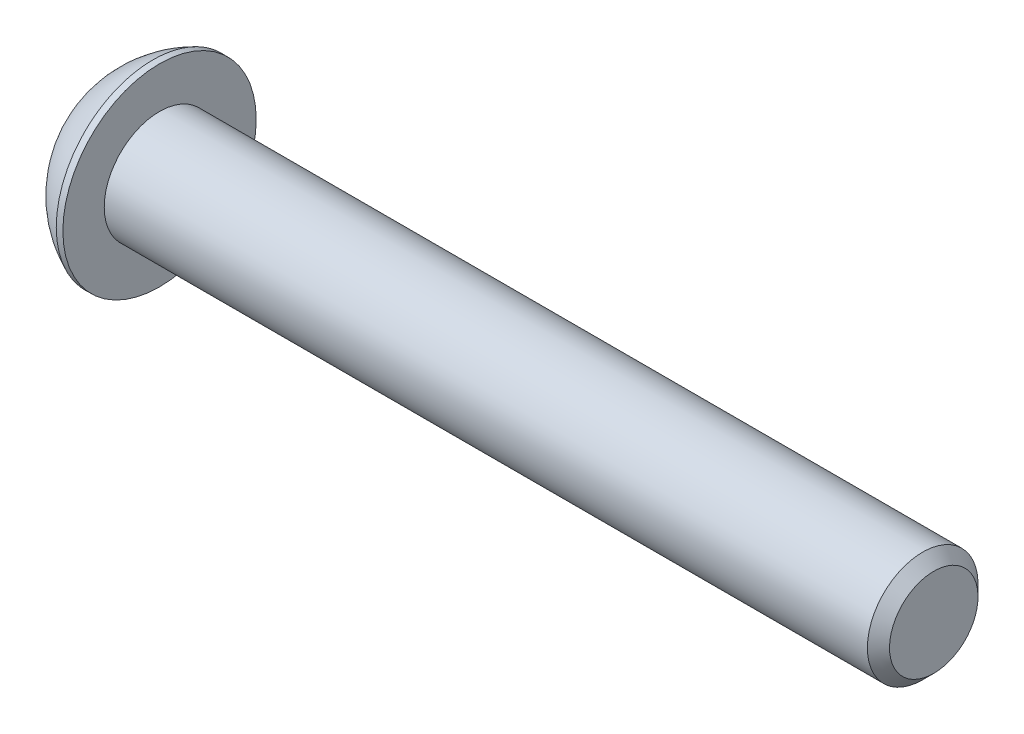
ISO-10303-21;
HEADER;
FILE_DESCRIPTION(('STEP AP214'),'2;1');
FILE_NAME('part.step','',(''),(''),'','','');
FILE_SCHEMA(('AUTOMOTIVE_DESIGN { 1 0 10303 214 1 1 1 1 }'));
ENDSEC;
DATA;
#1=APPLICATION_CONTEXT('core data for automotive mechanical design processes');
#2=APPLICATION_PROTOCOL_DEFINITION('international standard','automotive_design',2000,#1);
#3=PRODUCT_CONTEXT('',#1,'mechanical');
#4=PRODUCT('Part','Part','',(#3));
#5=PRODUCT_RELATED_PRODUCT_CATEGORY('part','',(#4));
#6=PRODUCT_DEFINITION_FORMATION('','',#4);
#7=PRODUCT_DEFINITION_CONTEXT('part definition',#1,'design');
#8=PRODUCT_DEFINITION('design','',#6,#7);
#9=PRODUCT_DEFINITION_SHAPE('','',#8);
#10=(LENGTH_UNIT() NAMED_UNIT(*) SI_UNIT(.MILLI.,.METRE.));
#11=(NAMED_UNIT(*) PLANE_ANGLE_UNIT() SI_UNIT($,.RADIAN.));
#12=(NAMED_UNIT(*) SI_UNIT($,.STERADIAN.) SOLID_ANGLE_UNIT());
#13=UNCERTAINTY_MEASURE_WITH_UNIT(LENGTH_MEASURE(1.E-05),#10,'distance_accuracy_value','');
#14=(GEOMETRIC_REPRESENTATION_CONTEXT(3) GLOBAL_UNCERTAINTY_ASSIGNED_CONTEXT((#13)) GLOBAL_UNIT_ASSIGNED_CONTEXT((#10,
#11,#12)) REPRESENTATION_CONTEXT('',''));
#15=CARTESIAN_POINT('',(0.,0.,0.));
#16=DIRECTION('',(0.,0.,1.));
#17=DIRECTION('',(1.,0.,0.));
#18=AXIS2_PLACEMENT_3D('',#15,#16,#17);
#19=CARTESIAN_POINT('',(1.32080000000034,0.,0.));
#20=DIRECTION('',(-1.,0.,0.));
#21=DIRECTION('',(0.,0.,1.));
#22=AXIS2_PLACEMENT_3D('',#19,#20,#21);
#23=CONICAL_SURFACE('',#22,1.1937999999998,1.04719755119608);
#24=CARTESIAN_POINT('',(2.01004075135902,0.,-4.44089209850063E-13));
#25=VERTEX_POINT('',#24);
#26=VERTEX_LOOP('',#25);
#27=FACE_BOUND('',#26,.T.);
#28=CARTESIAN_POINT('',(1.32080000000009,0.,0.));
#29=DIRECTION('',(-1.,0.,0.));
#30=DIRECTION('',(0.,0.,1.));
#31=AXIS2_PLACEMENT_3D('',#28,#29,#30);
#32=CIRCLE('',#31,1.19380000000024);
#33=CARTESIAN_POINT('',(1.32080000000009,0.,1.19380000000024));
#34=VERTEX_POINT('',#33);
#35=EDGE_CURVE('E20',#34,#34,#32,.T.);
#36=ORIENTED_EDGE('',*,*,#35,.T.);
#37=EDGE_LOOP('',(#36));
#38=FACE_BOUND('',#37,.T.);
#39=ADVANCED_FACE('F17',(#27,#38),#23,.F.);
#40=CARTESIAN_POINT('',(1.3208,-2.29135888084633,0.));
#41=DIRECTION('',(1.,0.,0.));
#42=DIRECTION('',(0.,0.,-1.));
#43=AXIS2_PLACEMENT_3D('',#40,#41,#42);
#44=PLANE('',#43);
#45=DIRECTION('',(0.,1.,0.));
#46=VECTOR('',#45,1.);
#47=CARTESIAN_POINT('',(1.3208,-1.14567944042316,1.984375));
#48=LINE('',#47,#46);
#49=CARTESIAN_POINT('',(1.3208,1.14567944042316,1.984375));
#50=VERTEX_POINT('',#49);
#51=CARTESIAN_POINT('',(1.3208,-1.14567944042316,1.984375));
#52=VERTEX_POINT('',#51);
#53=EDGE_CURVE('E69',#50,#52,#48,.F.);
#54=ORIENTED_EDGE('',*,*,#53,.F.);
#55=DIRECTION('',(0.,0.5,-0.866025403784439));
#56=VECTOR('',#55,1.);
#57=CARTESIAN_POINT('',(1.3208,1.14567944042316,1.984375));
#58=LINE('',#57,#56);
#59=CARTESIAN_POINT('',(1.3208,2.29135888084633,0.));
#60=VERTEX_POINT('',#59);
#61=EDGE_CURVE('E287',#60,#50,#58,.F.);
#62=ORIENTED_EDGE('',*,*,#61,.F.);
#63=DIRECTION('',(0.,-0.5,-0.866025403784439));
#64=VECTOR('',#63,1.);
#65=CARTESIAN_POINT('',(1.3208,2.29135888084633,0.));
#66=LINE('',#65,#64);
#67=CARTESIAN_POINT('',(1.3208,1.14567944042316,-1.984375));
#68=VERTEX_POINT('',#67);
#69=EDGE_CURVE('E291',#68,#60,#66,.F.);
#70=ORIENTED_EDGE('',*,*,#69,.F.);
#71=DIRECTION('',(0.,1.,0.));
#72=VECTOR('',#71,1.);
#73=CARTESIAN_POINT('',(1.3208,1.14567944042316,-1.984375));
#74=LINE('',#73,#72);
#75=CARTESIAN_POINT('',(1.3208,-1.14567944042316,-1.984375));
#76=VERTEX_POINT('',#75);
#77=EDGE_CURVE('E296',#76,#68,#74,.T.);
#78=ORIENTED_EDGE('',*,*,#77,.F.);
#79=DIRECTION('',(0.,-0.500000000000001,0.866025403784438));
#80=VECTOR('',#79,1.);
#81=CARTESIAN_POINT('',(1.3208,-1.14567944042316,-1.984375));
#82=LINE('',#81,#80);
#83=CARTESIAN_POINT('',(1.3208,-2.29135888084633,0.));
#84=VERTEX_POINT('',#83);
#85=EDGE_CURVE('E301',#84,#76,#82,.F.);
#86=ORIENTED_EDGE('',*,*,#85,.F.);
#87=DIRECTION('',(0.,0.500000000000001,0.866025403784438));
#88=VECTOR('',#87,1.);
#89=CARTESIAN_POINT('',(1.3208,-2.29135888084633,0.));
#90=LINE('',#89,#88);
#91=EDGE_CURVE('E82',#52,#84,#90,.F.);
#92=ORIENTED_EDGE('',*,*,#91,.F.);
#93=EDGE_LOOP('',(#54,#62,#70,#78,#86,#92));
#94=FACE_BOUND('',#93,.T.);
#95=ORIENTED_EDGE('',*,*,#35,.F.);
#96=EDGE_LOOP('',(#95));
#97=FACE_BOUND('',#96,.T.);
#98=ADVANCED_FACE('F75',(#94,#97),#44,.F.);
#99=CARTESIAN_POINT('',(1.3208,-1.14567944042316,1.984375));
#100=DIRECTION('',(0.,0.,-1.));
#101=DIRECTION('',(0.,1.,0.));
#102=AXIS2_PLACEMENT_3D('',#99,#100,#101);
#103=PLANE('',#102);
#104=ORIENTED_EDGE('',*,*,#53,.T.);
#105=DIRECTION('',(1.,0.,0.));
#106=VECTOR('',#105,1.);
#107=CARTESIAN_POINT('',(1.3208,-1.14567944042316,1.984375));
#108=LINE('',#107,#106);
#109=CARTESIAN_POINT('',(0.,-1.14567944042316,1.984375));
#110=VERTEX_POINT('',#109);
#111=EDGE_CURVE('E79',#110,#52,#108,.T.);
#112=ORIENTED_EDGE('',*,*,#111,.F.);
#113=DIRECTION('',(0.,1.,0.));
#114=VECTOR('',#113,1.);
#115=CARTESIAN_POINT('',(0.,0.,1.984375));
#116=LINE('',#115,#114);
#117=CARTESIAN_POINT('',(0.,1.14567944042316,1.984375));
#118=VERTEX_POINT('',#117);
#119=EDGE_CURVE('E281',#118,#110,#116,.F.);
#120=ORIENTED_EDGE('',*,*,#119,.F.);
#121=DIRECTION('',(1.,0.,0.));
#122=VECTOR('',#121,1.);
#123=CARTESIAN_POINT('',(1.3208,1.14567944042316,1.984375));
#124=LINE('',#123,#122);
#125=EDGE_CURVE('E284',#50,#118,#124,.F.);
#126=ORIENTED_EDGE('',*,*,#125,.F.);
#127=EDGE_LOOP('',(#104,#112,#120,#126));
#128=FACE_BOUND('',#127,.T.);
#129=ADVANCED_FACE('F128',(#128),#103,.T.);
#130=CARTESIAN_POINT('',(1.3208,-2.29135888084633,0.));
#131=DIRECTION('',(0.,0.866025403784438,-0.500000000000001));
#132=DIRECTION('',(0.,0.500000000000001,0.866025403784438));
#133=AXIS2_PLACEMENT_3D('',#130,#131,#132);
#134=PLANE('',#133);
#135=ORIENTED_EDGE('',*,*,#91,.T.);
#136=DIRECTION('',(1.,0.,0.));
#137=VECTOR('',#136,1.);
#138=CARTESIAN_POINT('',(1.3208,-2.29135888084633,0.));
#139=LINE('',#138,#137);
#140=CARTESIAN_POINT('',(0.,-2.29135888084633,0.));
#141=VERTEX_POINT('',#140);
#142=EDGE_CURVE('E303',#141,#84,#139,.T.);
#143=ORIENTED_EDGE('',*,*,#142,.F.);
#144=DIRECTION('',(0.,-0.500000000000001,-0.866025403784438));
#145=VECTOR('',#144,1.);
#146=CARTESIAN_POINT('',(0.,-1.14567944042316,1.984375));
#147=LINE('',#146,#145);
#148=EDGE_CURVE('E278',#110,#141,#147,.T.);
#149=ORIENTED_EDGE('',*,*,#148,.F.);
#150=ORIENTED_EDGE('',*,*,#111,.T.);
#151=EDGE_LOOP('',(#135,#143,#149,#150));
#152=FACE_BOUND('',#151,.T.);
#153=ADVANCED_FACE('F124',(#152),#134,.T.);
#154=CARTESIAN_POINT('',(1.3208,-1.14567944042316,-1.984375));
#155=DIRECTION('',(0.,0.866025403784438,0.500000000000001));
#156=DIRECTION('',(0.,-0.500000000000001,0.866025403784438));
#157=AXIS2_PLACEMENT_3D('',#154,#155,#156);
#158=PLANE('',#157);
#159=ORIENTED_EDGE('',*,*,#85,.T.);
#160=DIRECTION('',(1.,0.,0.));
#161=VECTOR('',#160,1.);
#162=CARTESIAN_POINT('',(1.3208,-1.14567944042316,-1.984375));
#163=LINE('',#162,#161);
#164=CARTESIAN_POINT('',(0.,-1.14567944042316,-1.984375));
#165=VERTEX_POINT('',#164);
#166=EDGE_CURVE('E298',#165,#76,#163,.T.);
#167=ORIENTED_EDGE('',*,*,#166,.F.);
#168=DIRECTION('',(0.,0.500000000000001,-0.866025403784438));
#169=VECTOR('',#168,1.);
#170=CARTESIAN_POINT('',(0.,-2.29135888084633,0.));
#171=LINE('',#170,#169);
#172=EDGE_CURVE('E275',#141,#165,#171,.T.);
#173=ORIENTED_EDGE('',*,*,#172,.F.);
#174=ORIENTED_EDGE('',*,*,#142,.T.);
#175=EDGE_LOOP('',(#159,#167,#173,#174));
#176=FACE_BOUND('',#175,.T.);
#177=ADVANCED_FACE('F120',(#176),#158,.T.);
#178=CARTESIAN_POINT('',(1.3208,1.14567944042316,-1.984375));
#179=DIRECTION('',(0.,0.,1.));
#180=DIRECTION('',(1.,0.,0.));
#181=AXIS2_PLACEMENT_3D('',#178,#179,#180);
#182=PLANE('',#181);
#183=ORIENTED_EDGE('',*,*,#77,.T.);
#184=DIRECTION('',(1.,0.,0.));
#185=VECTOR('',#184,1.);
#186=CARTESIAN_POINT('',(1.3208,1.14567944042316,-1.984375));
#187=LINE('',#186,#185);
#188=CARTESIAN_POINT('',(0.,1.14567944042316,-1.984375));
#189=VERTEX_POINT('',#188);
#190=EDGE_CURVE('E293',#189,#68,#187,.T.);
#191=ORIENTED_EDGE('',*,*,#190,.F.);
#192=DIRECTION('',(0.,1.,0.));
#193=VECTOR('',#192,1.);
#194=CARTESIAN_POINT('',(0.,0.,-1.984375));
#195=LINE('',#194,#193);
#196=EDGE_CURVE('E272',#165,#189,#195,.T.);
#197=ORIENTED_EDGE('',*,*,#196,.F.);
#198=ORIENTED_EDGE('',*,*,#166,.T.);
#199=EDGE_LOOP('',(#183,#191,#197,#198));
#200=FACE_BOUND('',#199,.T.);
#201=ADVANCED_FACE('F117',(#200),#182,.T.);
#202=CARTESIAN_POINT('',(1.3208,2.29135888084633,0.));
#203=DIRECTION('',(0.,-0.866025403784439,0.5));
#204=DIRECTION('',(0.,-0.5,-0.866025403784439));
#205=AXIS2_PLACEMENT_3D('',#202,#203,#204);
#206=PLANE('',#205);
#207=ORIENTED_EDGE('',*,*,#69,.T.);
#208=DIRECTION('',(1.,0.,0.));
#209=VECTOR('',#208,1.);
#210=CARTESIAN_POINT('',(1.3208,2.29135888084633,0.));
#211=LINE('',#210,#209);
#212=CARTESIAN_POINT('',(0.,2.29135888084633,0.));
#213=VERTEX_POINT('',#212);
#214=EDGE_CURVE('E35',#213,#60,#211,.T.);
#215=ORIENTED_EDGE('',*,*,#214,.F.);
#216=DIRECTION('',(0.,0.5,0.866025403784439));
#217=VECTOR('',#216,1.);
#218=CARTESIAN_POINT('',(0.,1.14567944042316,-1.984375));
#219=LINE('',#218,#217);
#220=EDGE_CURVE('E269',#189,#213,#219,.T.);
#221=ORIENTED_EDGE('',*,*,#220,.F.);
#222=ORIENTED_EDGE('',*,*,#190,.T.);
#223=EDGE_LOOP('',(#207,#215,#221,#222));
#224=FACE_BOUND('',#223,.T.);
#225=ADVANCED_FACE('F113',(#224),#206,.T.);
#226=CARTESIAN_POINT('',(1.3208,1.14567944042316,1.984375));
#227=DIRECTION('',(0.,-0.866025403784439,-0.5));
#228=DIRECTION('',(0.,0.5,-0.866025403784439));
#229=AXIS2_PLACEMENT_3D('',#226,#227,#228);
#230=PLANE('',#229);
#231=ORIENTED_EDGE('',*,*,#61,.T.);
#232=ORIENTED_EDGE('',*,*,#125,.T.);
#233=DIRECTION('',(0.,-0.5,0.866025403784438));
#234=VECTOR('',#233,1.);
#235=CARTESIAN_POINT('',(0.,2.29135888084633,0.));
#236=LINE('',#235,#234);
#237=EDGE_CURVE('E100',#213,#118,#236,.T.);
#238=ORIENTED_EDGE('',*,*,#237,.F.);
#239=ORIENTED_EDGE('',*,*,#214,.T.);
#240=EDGE_LOOP('',(#231,#232,#238,#239));
#241=FACE_BOUND('',#240,.T.);
#242=ADVANCED_FACE('F109',(#241),#230,.T.);
#243=CARTESIAN_POINT('',(0.,0.,0.));
#244=DIRECTION('',(-1.,0.,0.));
#245=DIRECTION('',(0.,0.,1.));
#246=AXIS2_PLACEMENT_3D('',#243,#244,#245);
#247=PLANE('',#246);
#248=ORIENTED_EDGE('',*,*,#220,.T.);
#249=ORIENTED_EDGE('',*,*,#237,.T.);
#250=ORIENTED_EDGE('',*,*,#119,.T.);
#251=ORIENTED_EDGE('',*,*,#148,.T.);
#252=ORIENTED_EDGE('',*,*,#172,.T.);
#253=ORIENTED_EDGE('',*,*,#196,.T.);
#254=EDGE_LOOP('',(#248,#249,#250,#251,#252,#253));
#255=FACE_BOUND('',#254,.T.);
#256=CARTESIAN_POINT('',(0.,2.77495,0.));
#257=CARTESIAN_POINT('',(0.,2.77494953309947,0.0779118937523459));
#258=CARTESIAN_POINT('',(0.,2.77166578388025,0.15583810591977));
#259=CARTESIAN_POINT('',(0.,2.75855213600204,0.311152012455904));
#260=CARTESIAN_POINT('',(0.,2.74872030471467,0.388539541019556));
#261=CARTESIAN_POINT('',(0.,2.72255472645676,0.542341518735717));
#262=CARTESIAN_POINT('',(-2.70414110576258E-13,2.70621065843663,0.618754223567578));
#263=CARTESIAN_POINT('',(2.71501725221868E-13,2.66713326915777,0.769973634286023));
#264=CARTESIAN_POINT('',(1.01274952524446E-12,2.64439476297869,0.844778983646282));
#265=CARTESIAN_POINT('',(1.81909959813207E-12,2.56690195943351,1.06566239301792));
#266=CARTESIAN_POINT('',(4.77081687541822E-13,2.50280672569928,1.20857954243987));
#267=CARTESIAN_POINT('',(-4.76232447128612E-13,2.35149826934097,1.48160874561538));
#268=CARTESIAN_POINT('',(0.,2.26428416790397,1.61172031233499));
#269=CARTESIAN_POINT('',(0.,2.1181093928834,1.79445660654268));
#270=CARTESIAN_POINT('',(0.,2.06678693791626,1.85333128513996));
#271=CARTESIAN_POINT('',(0.,1.95940522984449,1.96650727912792));
#272=CARTESIAN_POINT('',(0.,1.90335059143535,2.02081294920044));
#273=CARTESIAN_POINT('',(0.,1.78683891013963,2.12453280878582));
#274=CARTESIAN_POINT('',(0.,1.72637988450322,2.1739447713554));
#275=CARTESIAN_POINT('',(0.,1.60151968865711,2.26750481692908));
#276=CARTESIAN_POINT('',(0.,1.53711760864537,2.31165167810847));
#277=CARTESIAN_POINT('',(0.,1.33869902291632,2.43567242603944));
#278=CARTESIAN_POINT('',(0.,1.19934704110695,2.507235886628));
#279=CARTESIAN_POINT('',(0.,0.910681609121881,2.62590828672821));
#280=CARTESIAN_POINT('',(0.,0.761368265357398,2.67301748742278));
#281=CARTESIAN_POINT('',(0.,0.456932649466623,2.74151230664007));
#282=CARTESIAN_POINT('',(0.,0.301810346322584,2.76289778778721));
#283=CARTESIAN_POINT('',(0.,-0.00982263870895171,2.77931595661156));
#284=CARTESIAN_POINT('',(0.,-0.166333320596448,2.77434864428877));
#285=CARTESIAN_POINT('',(0.,-0.476280836814452,2.73822217653073));
#286=CARTESIAN_POINT('',(0.,-0.629717687555985,2.70706316096981));
#287=CARTESIAN_POINT('',(0.,-0.929254830044274,2.61937980771149));
#288=CARTESIAN_POINT('',(0.,-1.0753550434132,2.56285519909568));
#289=CARTESIAN_POINT('',(0.,-1.28570692598579,2.46037024128109));
#290=CARTESIAN_POINT('',(0.,-1.35439130022287,2.42323494812896));
#291=CARTESIAN_POINT('',(0.,-1.488391287199,2.34331277270256));
#292=CARTESIAN_POINT('',(0.,-1.55370767631787,2.30052720108831));
#293=CARTESIAN_POINT('',(0.,-1.68047292776594,2.20962421887055));
#294=CARTESIAN_POINT('',(0.,-1.7419235278682,2.16150923122348));
#295=CARTESIAN_POINT('',(0.,-1.86060297067992,2.06024311301283));
#296=CARTESIAN_POINT('',(0.,-1.91782768181715,2.0070871669763));
#297=CARTESIAN_POINT('',(0.,-2.08239462196651,1.8407220856554));
#298=CARTESIAN_POINT('',(0.,-2.18279764272601,1.72049499758422));
#299=CARTESIAN_POINT('',(0.,-2.36195754944063,1.46487629213018));
#300=CARTESIAN_POINT('',(0.,-2.44071525816758,1.32948525142807));
#301=CARTESIAN_POINT('',(0.,-2.54098882695274,1.11796734074395));
#302=CARTESIAN_POINT('',(0.,-2.57146177392727,1.04596540008347));
#303=CARTESIAN_POINT('',(0.,-2.62621251108999,0.899689259475764));
#304=CARTESIAN_POINT('',(0.,-2.65049531495563,0.825416953360952));
#305=CARTESIAN_POINT('',(0.,-2.69267708798766,0.675215808695207));
#306=CARTESIAN_POINT('',(0.,-2.71058613777937,0.599289789313092));
#307=CARTESIAN_POINT('',(0.,-2.73994710360127,0.446213628496932));
#308=CARTESIAN_POINT('',(0.,-2.75140092413871,0.369063855024788));
#309=CARTESIAN_POINT('',(0.,-2.76470470685522,0.24316208817343));
#310=CARTESIAN_POINT('',(0.,-2.76854547596618,0.194611672428577));
#311=CARTESIAN_POINT('',(0.,-2.77366826843264,0.0973760351839812));
#312=CARTESIAN_POINT('',(0.,-2.77495029178814,0.0486908136842395));
#313=CARTESIAN_POINT('',(0.,-2.77494953309947,-0.0779118937523475));
#314=CARTESIAN_POINT('',(0.,-2.77166578388025,-0.155838105919772));
#315=CARTESIAN_POINT('',(0.,-2.75855213600204,-0.311152012455906));
#316=CARTESIAN_POINT('',(0.,-2.74872030471467,-0.388539541019558));
#317=CARTESIAN_POINT('',(0.,-2.72255472645677,-0.542341518735719));
#318=CARTESIAN_POINT('',(-2.70149297926331E-13,-2.70621065843663,-0.61875422356758));
#319=CARTESIAN_POINT('',(2.712366972268E-13,-2.66713326915777,-0.769973634286024));
#320=CARTESIAN_POINT('',(1.0114146773846E-12,-2.64439476297869,-0.844778983646283));
#321=CARTESIAN_POINT('',(1.81656702958366E-12,-2.5669019594335,-1.06566239301792));
#322=CARTESIAN_POINT('',(4.7641829195856E-13,-2.50280672569928,-1.20857954243988));
#323=CARTESIAN_POINT('',(-4.75569026324205E-13,-2.35149826934097,-1.48160874561538));
#324=CARTESIAN_POINT('',(0.,-2.26428416790396,-1.61172031233499));
#325=CARTESIAN_POINT('',(0.,-2.1181093928834,-1.79445660654268));
#326=CARTESIAN_POINT('',(0.,-2.06678693791626,-1.85333128513997));
#327=CARTESIAN_POINT('',(0.,-1.95940522984449,-1.96650727912792));
#328=CARTESIAN_POINT('',(0.,-1.90335059143535,-2.02081294920044));
#329=CARTESIAN_POINT('',(0.,-1.78683891013963,-2.12453280878582));
#330=CARTESIAN_POINT('',(0.,-1.72637988450322,-2.1739447713554));
#331=CARTESIAN_POINT('',(0.,-1.60151968865711,-2.26750481692908));
#332=CARTESIAN_POINT('',(0.,-1.53711760864537,-2.31165167810847));
#333=CARTESIAN_POINT('',(0.,-1.33869902291632,-2.43567242603944));
#334=CARTESIAN_POINT('',(0.,-1.19934704110695,-2.507235886628));
#335=CARTESIAN_POINT('',(0.,-0.91068160912188,-2.62590828672821));
#336=CARTESIAN_POINT('',(0.,-0.761368265357396,-2.67301748742278));
#337=CARTESIAN_POINT('',(0.,-0.456932649466621,-2.74151230664007));
#338=CARTESIAN_POINT('',(0.,-0.301810346322582,-2.76289778778721));
#339=CARTESIAN_POINT('',(0.,0.00982263870895353,-2.77931595661156));
#340=CARTESIAN_POINT('',(0.,0.16633332059645,-2.77434864428876));
#341=CARTESIAN_POINT('',(0.,0.476280836814454,-2.73822217653073));
#342=CARTESIAN_POINT('',(0.,0.629717687555987,-2.70706316096981));
#343=CARTESIAN_POINT('',(0.,0.929254830044276,-2.6193798077115));
#344=CARTESIAN_POINT('',(0.,1.0753550434132,-2.56285519909568));
#345=CARTESIAN_POINT('',(0.,1.28570692598579,-2.46037024128109));
#346=CARTESIAN_POINT('',(0.,1.35439130022287,-2.42323494812896));
#347=CARTESIAN_POINT('',(0.,1.488391287199,-2.34331277270256));
#348=CARTESIAN_POINT('',(0.,1.55370767631787,-2.30052720108831));
#349=CARTESIAN_POINT('',(0.,1.68047292776594,-2.20962421887055));
#350=CARTESIAN_POINT('',(0.,1.7419235278682,-2.16150923122348));
#351=CARTESIAN_POINT('',(0.,1.86060297067992,-2.06024311301282));
#352=CARTESIAN_POINT('',(0.,1.91782768181716,-2.0070871669763));
#353=CARTESIAN_POINT('',(0.,2.08239462196651,-1.8407220856554));
#354=CARTESIAN_POINT('',(0.,2.18279764272601,-1.72049499758422));
#355=CARTESIAN_POINT('',(0.,2.36195754944063,-1.46487629213018));
#356=CARTESIAN_POINT('',(0.,2.44071525816757,-1.32948525142807));
#357=CARTESIAN_POINT('',(0.,2.54098882695273,-1.11796734074395));
#358=CARTESIAN_POINT('',(0.,2.57146177392727,-1.04596540008347));
#359=CARTESIAN_POINT('',(0.,2.62621251108999,-0.899689259475765));
#360=CARTESIAN_POINT('',(0.,2.65049531495563,-0.825416953360953));
#361=CARTESIAN_POINT('',(0.,2.69267708798766,-0.675215808695207));
#362=CARTESIAN_POINT('',(0.,2.71058613777936,-0.599289789313092));
#363=CARTESIAN_POINT('',(0.,2.73994710360127,-0.446213628496932));
#364=CARTESIAN_POINT('',(0.,2.75140092413871,-0.369063855024789));
#365=CARTESIAN_POINT('',(0.,2.76470470685522,-0.243162088173432));
#366=CARTESIAN_POINT('',(0.,2.76854547596618,-0.194611672428578));
#367=CARTESIAN_POINT('',(0.,2.77366826843264,-0.0973760351839823));
#368=CARTESIAN_POINT('',(0.,2.77495029178814,-0.0486908136842408));
#369=CARTESIAN_POINT('',(0.,2.77495,0.));
#370=B_SPLINE_CURVE_WITH_KNOTS('',3,(#256,#257,#258,#259,#260,#261,#262,#263,#264,#265,#266,
#267,#268,#269,#270,#271,#272,#273,#274,#275,#276,#277,#278,#279,#280,#281,#282,#283,#284,#285,
#286,#287,#288,#289,#290,#291,#292,#293,#294,#295,#296,#297,#298,#299,#300,#301,#302,#303,#304,
#305,#306,#307,#308,#309,#310,#311,#312,#313,#314,#315,#316,#317,#318,#319,#320,#321,#322,#323,
#324,#325,#326,#327,#328,#329,#330,#331,#332,#333,#334,#335,#336,#337,#338,#339,#340,#341,#342,
#343,#344,#345,#346,#347,#348,#349,#350,#351,#352,#353,#354,#355,#356,#357,#358,#359,#360,#361,
#362,#363,#364,#365,#366,#367,#368,#369),.UNSPECIFIED.,.T.,.F.,(4,2,2,2,2,2,2,2,2,2,2,2,2,2,2,2,
2,2,2,2,2,2,2,2,2,2,2,2,2,2,2,2,2,2,2,2,2,2,2,2,2,2,2,2,2,2,2,2,2,2,2,2,2,2,2,2,4),(0.,
0.233690856748162,0.467450716578751,0.701582538521471,0.935904756015414,1.40343220467667,
1.87097742791502,2.10505636898837,2.33890962270652,2.57286880998746,2.80688218486306,
3.27442101763127,3.74195485676357,4.20949119271389,4.67702752866417,5.14456136779641,
5.61210020056468,5.84611357544033,6.08007276272136,6.31392601643949,6.54800495751273,
7.01555018075072,7.48307762941212,7.71739984690652,7.95153166884955,8.18529152868023,
8.41898238542855,8.56502681353347,8.71107124163843,8.94476209838659,9.17852195821718,
9.4126537801599,9.64697599765384,10.1145034463151,10.5820486695534,10.8161276106268,
11.0499808643449,11.2839400516259,11.5179534265015,11.9854922592697,12.453026098402,
12.9205624343523,13.3880987703026,13.8556326094348,14.3231714422031,14.5571848170788,
14.7911440043598,15.0249972580779,15.2590761991512,15.7266214223891,16.1941488710506,
16.4284710885449,16.662602910488,16.8963627703186,17.130053627067,17.2760980551719,
17.4221424832769),.UNSPECIFIED.);
#371=CARTESIAN_POINT('',(0.,2.77495,0.));
#372=VERTEX_POINT('',#371);
#373=EDGE_CURVE('E94',#372,#372,#370,.T.);
#374=ORIENTED_EDGE('',*,*,#373,.F.);
#375=EDGE_LOOP('',(#374));
#376=FACE_BOUND('',#375,.T.);
#377=ADVANCED_FACE('F105',(#255,#376),#247,.T.);
#378=CARTESIAN_POINT('',(5.37260881410256,0.,0.));
#379=DIRECTION('',(0.,1.,0.));
#380=DIRECTION('',(1.,0.,0.));
#381=AXIS2_PLACEMENT_3D('',#378,#379,#380);
#382=SPHERICAL_SURFACE('',#381,6.04692260342999);
#383=CARTESIAN_POINT('',(2.9718,0.,0.));
#384=DIRECTION('',(-1.,0.,0.));
#385=DIRECTION('',(0.,0.,1.));
#386=AXIS2_PLACEMENT_3D('',#383,#384,#385);
#387=CIRCLE('',#386,5.5499);
#388=CARTESIAN_POINT('',(2.9718,0.,5.5499));
#389=VERTEX_POINT('',#388);
#390=EDGE_CURVE('E92',#389,#389,#387,.F.);
#391=ORIENTED_EDGE('',*,*,#390,.F.);
#392=EDGE_LOOP('',(#391));
#393=FACE_BOUND('',#392,.T.);
#394=ORIENTED_EDGE('',*,*,#373,.T.);
#395=EDGE_LOOP('',(#394));
#396=FACE_BOUND('',#395,.T.);
#397=ADVANCED_FACE('F101',(#393,#396),#382,.T.);
#398=CARTESIAN_POINT('',(47.8028,0.,0.));
#399=DIRECTION('',(-1.,0.,0.));
#400=DIRECTION('',(0.,0.,1.));
#401=AXIS2_PLACEMENT_3D('',#398,#399,#400);
#402=PLANE('',#401);
#403=CARTESIAN_POINT('',(47.8027999999995,0.,0.));
#404=DIRECTION('',(-1.,0.,0.));
#405=DIRECTION('',(0.,-1.,0.));
#406=AXIS2_PLACEMENT_3D('',#403,#404,#405);
#407=CIRCLE('',#406,2.54000000001042);
#408=CARTESIAN_POINT('',(47.8027999999995,-2.54000000001042,0.));
#409=VERTEX_POINT('',#408);
#410=EDGE_CURVE('E89',#409,#409,#407,.T.);
#411=ORIENTED_EDGE('',*,*,#410,.F.);
#412=EDGE_LOOP('',(#411));
#413=FACE_BOUND('',#412,.T.);
#414=ADVANCED_FACE('F154',(#413),#402,.F.);
#415=CARTESIAN_POINT('',(0.,0.,0.));
#416=DIRECTION('',(-1.,0.,0.));
#417=DIRECTION('',(0.,0.,1.));
#418=AXIS2_PLACEMENT_3D('',#415,#416,#417);
#419=CYLINDRICAL_SURFACE('',#418,5.5499);
#420=ORIENTED_EDGE('',*,*,#390,.T.);
#421=EDGE_LOOP('',(#420));
#422=FACE_BOUND('',#421,.T.);
#423=CARTESIAN_POINT('',(3.3528,0.,0.));
#424=DIRECTION('',(-1.,0.,0.));
#425=DIRECTION('',(0.,0.,1.));
#426=AXIS2_PLACEMENT_3D('',#423,#424,#425);
#427=CIRCLE('',#426,5.5499);
#428=CARTESIAN_POINT('',(3.3528,0.,5.5499));
#429=VERTEX_POINT('',#428);
#430=EDGE_CURVE('E86',#429,#429,#427,.T.);
#431=ORIENTED_EDGE('',*,*,#430,.T.);
#432=EDGE_LOOP('',(#431));
#433=FACE_BOUND('',#432,.T.);
#434=ADVANCED_FACE('F151',(#422,#433),#419,.T.);
#435=CARTESIAN_POINT('',(47.1677999999542,0.,0.));
#436=DIRECTION('',(-1.,0.,0.));
#437=DIRECTION('',(0.,-1.,0.));
#438=AXIS2_PLACEMENT_3D('',#435,#436,#437);
#439=CONICAL_SURFACE('',#438,3.17500000005566,0.785398163397448);
#440=CARTESIAN_POINT('',(47.1678,0.,0.));
#441=DIRECTION('',(-1.,0.,0.));
#442=DIRECTION('',(0.,0.,1.));
#443=AXIS2_PLACEMENT_3D('',#440,#441,#442);
#444=CIRCLE('',#443,3.175);
#445=CARTESIAN_POINT('',(47.1678,0.,3.175));
#446=VERTEX_POINT('',#445);
#447=EDGE_CURVE('E26',#446,#446,#444,.T.);
#448=ORIENTED_EDGE('',*,*,#447,.F.);
#449=EDGE_LOOP('',(#448));
#450=FACE_BOUND('',#449,.T.);
#451=ORIENTED_EDGE('',*,*,#410,.T.);
#452=EDGE_LOOP('',(#451));
#453=FACE_BOUND('',#452,.T.);
#454=ADVANCED_FACE('F144',(#450,#453),#439,.T.);
#455=CARTESIAN_POINT('',(3.3528,3.175,0.));
#456=DIRECTION('',(-1.,0.,0.));
#457=DIRECTION('',(0.,0.,1.));
#458=AXIS2_PLACEMENT_3D('',#455,#456,#457);
#459=PLANE('',#458);
#460=CARTESIAN_POINT('',(3.3528,0.,0.));
#461=DIRECTION('',(-1.,0.,0.));
#462=DIRECTION('',(0.,0.,1.));
#463=AXIS2_PLACEMENT_3D('',#460,#461,#462);
#464=CIRCLE('',#463,3.175);
#465=CARTESIAN_POINT('',(3.3528,0.,3.175));
#466=VERTEX_POINT('',#465);
#467=EDGE_CURVE('E11',#466,#466,#464,.F.);
#468=ORIENTED_EDGE('',*,*,#467,.F.);
#469=EDGE_LOOP('',(#468));
#470=FACE_BOUND('',#469,.T.);
#471=ORIENTED_EDGE('',*,*,#430,.F.);
#472=EDGE_LOOP('',(#471));
#473=FACE_BOUND('',#472,.T.);
#474=ADVANCED_FACE('F138',(#470,#473),#459,.F.);
#475=CARTESIAN_POINT('',(0.,0.,0.));
#476=DIRECTION('',(-1.,0.,0.));
#477=DIRECTION('',(0.,0.,1.));
#478=AXIS2_PLACEMENT_3D('',#475,#476,#477);
#479=CYLINDRICAL_SURFACE('',#478,3.175);
#480=ORIENTED_EDGE('',*,*,#467,.T.);
#481=EDGE_LOOP('',(#480));
#482=FACE_BOUND('',#481,.T.);
#483=ORIENTED_EDGE('',*,*,#447,.T.);
#484=EDGE_LOOP('',(#483));
#485=FACE_BOUND('',#484,.T.);
#486=ADVANCED_FACE('F136',(#482,#485),#479,.T.);
#487=CLOSED_SHELL('',(#39,#98,#129,#153,#177,#201,#225,#242,#377,#397,#414,#434,#454,#474,#486));
#488=MANIFOLD_SOLID_BREP('B1',#487);
#489=ADVANCED_BREP_SHAPE_REPRESENTATION('',(#18,#488),#14);
#490=SHAPE_DEFINITION_REPRESENTATION(#9,#489);
ENDSEC;
END-ISO-10303-21;
